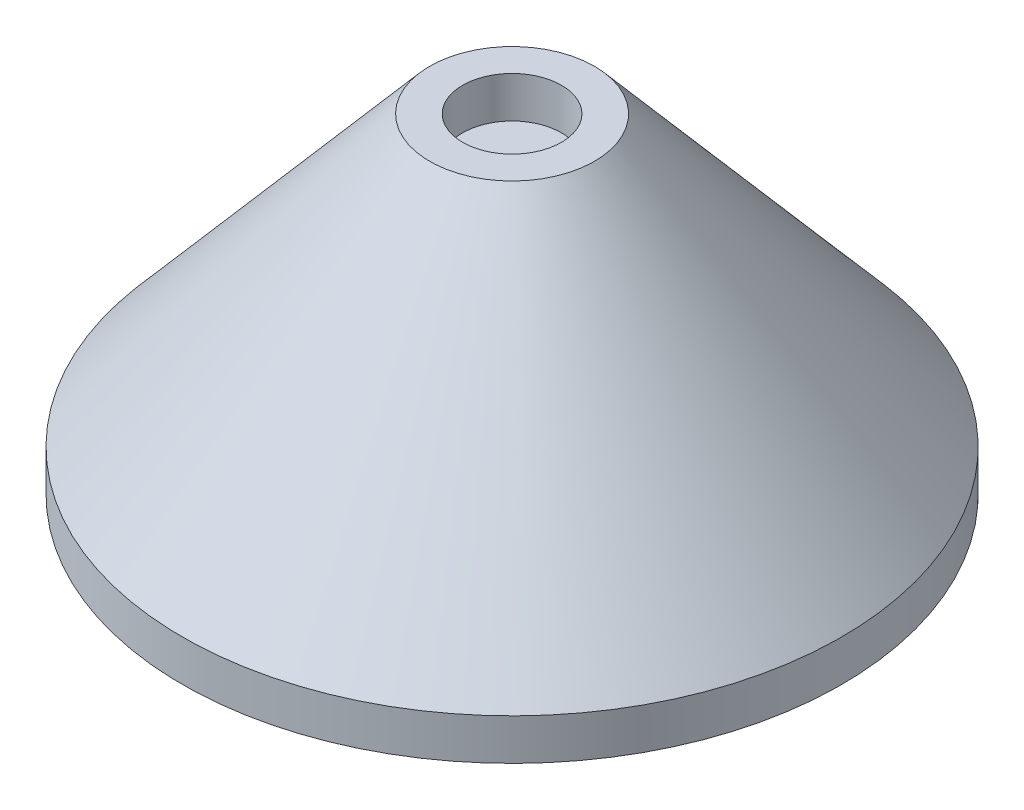
ISO-10303-21;
HEADER;
FILE_DESCRIPTION(('STEP AP214'),'2;1');
FILE_NAME('part.step','',(''),(''),'','','');
FILE_SCHEMA(('AUTOMOTIVE_DESIGN { 1 0 10303 214 1 1 1 1 }'));
ENDSEC;
DATA;
#1=APPLICATION_CONTEXT('core data for automotive mechanical design processes');
#2=APPLICATION_PROTOCOL_DEFINITION('international standard','automotive_design',2000,#1);
#3=PRODUCT_CONTEXT('',#1,'mechanical');
#4=PRODUCT('Part','Part','',(#3));
#5=PRODUCT_RELATED_PRODUCT_CATEGORY('part','',(#4));
#6=PRODUCT_DEFINITION_FORMATION('','',#4);
#7=PRODUCT_DEFINITION_CONTEXT('part definition',#1,'design');
#8=PRODUCT_DEFINITION('design','',#6,#7);
#9=PRODUCT_DEFINITION_SHAPE('','',#8);
#10=(LENGTH_UNIT() NAMED_UNIT(*) SI_UNIT(.MILLI.,.METRE.));
#11=(NAMED_UNIT(*) PLANE_ANGLE_UNIT() SI_UNIT($,.RADIAN.));
#12=(NAMED_UNIT(*) SI_UNIT($,.STERADIAN.) SOLID_ANGLE_UNIT());
#13=UNCERTAINTY_MEASURE_WITH_UNIT(LENGTH_MEASURE(1.E-05),#10,'distance_accuracy_value','');
#14=(GEOMETRIC_REPRESENTATION_CONTEXT(3) GLOBAL_UNCERTAINTY_ASSIGNED_CONTEXT((#13)) GLOBAL_UNIT_ASSIGNED_CONTEXT((#10,
#11,#12)) REPRESENTATION_CONTEXT('',''));
#15=CARTESIAN_POINT('',(0.,0.,0.));
#16=DIRECTION('',(0.,0.,1.));
#17=DIRECTION('',(1.,0.,0.));
#18=AXIS2_PLACEMENT_3D('',#15,#16,#17);
#19=CARTESIAN_POINT('',(0.,0.,0.));
#20=DIRECTION('',(0.,-1.,0.));
#21=DIRECTION('',(0.,0.,-1.));
#22=AXIS2_PLACEMENT_3D('',#19,#20,#21);
#23=PLANE('',#22);
#24=CARTESIAN_POINT('',(0.,0.,0.));
#25=DIRECTION('',(0.,1.,0.));
#26=DIRECTION('',(0.,0.,1.));
#27=AXIS2_PLACEMENT_3D('',#24,#25,#26);
#28=CIRCLE('',#27,6.);
#29=CARTESIAN_POINT('',(0.,0.,6.));
#30=VERTEX_POINT('',#29);
#31=EDGE_CURVE('E63',#30,#30,#28,.T.);
#32=ORIENTED_EDGE('',*,*,#31,.F.);
#33=EDGE_LOOP('',(#32));
#34=FACE_BOUND('',#33,.T.);
#35=CARTESIAN_POINT('',(0.,0.,0.));
#36=DIRECTION('',(0.,-1.,0.));
#37=DIRECTION('',(0.,0.,-1.));
#38=AXIS2_PLACEMENT_3D('',#35,#36,#37);
#39=CIRCLE('',#38,10.);
#40=CARTESIAN_POINT('',(0.,0.,-10.));
#41=VERTEX_POINT('',#40);
#42=EDGE_CURVE('E10',#41,#41,#39,.T.);
#43=ORIENTED_EDGE('',*,*,#42,.F.);
#44=EDGE_LOOP('',(#43));
#45=FACE_BOUND('',#44,.T.);
#46=ADVANCED_FACE('F43',(#34,#45),#23,.F.);
#47=CARTESIAN_POINT('',(0.,0.,0.));
#48=DIRECTION('',(0.,-1.,0.));
#49=DIRECTION('',(0.,0.,-1.));
#50=AXIS2_PLACEMENT_3D('',#47,#48,#49);
#51=CONICAL_SURFACE('',#50,10.,0.70862627212767);
#52=CARTESIAN_POINT('',(0.,-35.,0.));
#53=DIRECTION('',(0.,-1.,0.));
#54=DIRECTION('',(0.,0.,-1.));
#55=AXIS2_PLACEMENT_3D('',#52,#53,#54);
#56=CIRCLE('',#55,40.);
#57=CARTESIAN_POINT('',(0.,-35.,-40.));
#58=VERTEX_POINT('',#57);
#59=EDGE_CURVE('E50',#58,#58,#56,.T.);
#60=ORIENTED_EDGE('',*,*,#59,.F.);
#61=EDGE_LOOP('',(#60));
#62=FACE_BOUND('',#61,.T.);
#63=ORIENTED_EDGE('',*,*,#42,.T.);
#64=EDGE_LOOP('',(#63));
#65=FACE_BOUND('',#64,.T.);
#66=ADVANCED_FACE('F82',(#62,#65),#51,.T.);
#67=CARTESIAN_POINT('',(0.,-40.,0.));
#68=DIRECTION('',(0.,-1.,0.));
#69=DIRECTION('',(0.,0.,-1.));
#70=AXIS2_PLACEMENT_3D('',#67,#68,#69);
#71=CYLINDRICAL_SURFACE('',#70,40.);
#72=CARTESIAN_POINT('',(0.,-40.,0.));
#73=DIRECTION('',(0.,-1.,0.));
#74=DIRECTION('',(0.,0.,-1.));
#75=AXIS2_PLACEMENT_3D('',#72,#73,#74);
#76=CIRCLE('',#75,40.);
#77=CARTESIAN_POINT('',(0.,-40.,-40.));
#78=VERTEX_POINT('',#77);
#79=EDGE_CURVE('E55',#78,#78,#76,.T.);
#80=ORIENTED_EDGE('',*,*,#79,.F.);
#81=EDGE_LOOP('',(#80));
#82=FACE_BOUND('',#81,.T.);
#83=ORIENTED_EDGE('',*,*,#59,.T.);
#84=EDGE_LOOP('',(#83));
#85=FACE_BOUND('',#84,.T.);
#86=ADVANCED_FACE('F86',(#82,#85),#71,.T.);
#87=CARTESIAN_POINT('',(-40.,-40.,0.));
#88=DIRECTION('',(0.,1.,0.));
#89=DIRECTION('',(0.,0.,1.));
#90=AXIS2_PLACEMENT_3D('',#87,#88,#89);
#91=PLANE('',#90);
#92=ORIENTED_EDGE('',*,*,#79,.T.);
#93=EDGE_LOOP('',(#92));
#94=FACE_BOUND('',#93,.T.);
#95=ADVANCED_FACE('F76',(#94),#91,.F.);
#96=CARTESIAN_POINT('',(0.,-5.,0.));
#97=DIRECTION('',(0.,1.,0.));
#98=DIRECTION('',(0.,0.,1.));
#99=AXIS2_PLACEMENT_3D('',#96,#97,#98);
#100=CYLINDRICAL_SURFACE('',#99,6.);
#101=CARTESIAN_POINT('',(0.,-5.,0.));
#102=DIRECTION('',(0.,1.,0.));
#103=DIRECTION('',(0.,0.,1.));
#104=AXIS2_PLACEMENT_3D('',#101,#102,#103);
#105=CIRCLE('',#104,6.);
#106=CARTESIAN_POINT('',(0.,-5.,6.));
#107=VERTEX_POINT('',#106);
#108=EDGE_CURVE('E60',#107,#107,#105,.T.);
#109=ORIENTED_EDGE('',*,*,#108,.F.);
#110=EDGE_LOOP('',(#109));
#111=FACE_BOUND('',#110,.T.);
#112=ORIENTED_EDGE('',*,*,#31,.T.);
#113=EDGE_LOOP('',(#112));
#114=FACE_BOUND('',#113,.T.);
#115=ADVANCED_FACE('F73',(#111,#114),#100,.F.);
#116=CARTESIAN_POINT('',(0.,-5.,0.));
#117=DIRECTION('',(0.,1.,0.));
#118=DIRECTION('',(0.,0.,1.));
#119=AXIS2_PLACEMENT_3D('',#116,#117,#118);
#120=PLANE('',#119);
#121=ORIENTED_EDGE('',*,*,#108,.T.);
#122=EDGE_LOOP('',(#121));
#123=FACE_BOUND('',#122,.T.);
#124=ADVANCED_FACE('F71',(#123),#120,.T.);
#125=CLOSED_SHELL('',(#46,#66,#86,#95,#115,#124));
#126=MANIFOLD_SOLID_BREP('B2',#125);
#127=ADVANCED_BREP_SHAPE_REPRESENTATION('',(#18,#126),#14);
#128=SHAPE_DEFINITION_REPRESENTATION(#9,#127);
ENDSEC;
END-ISO-10303-21;
